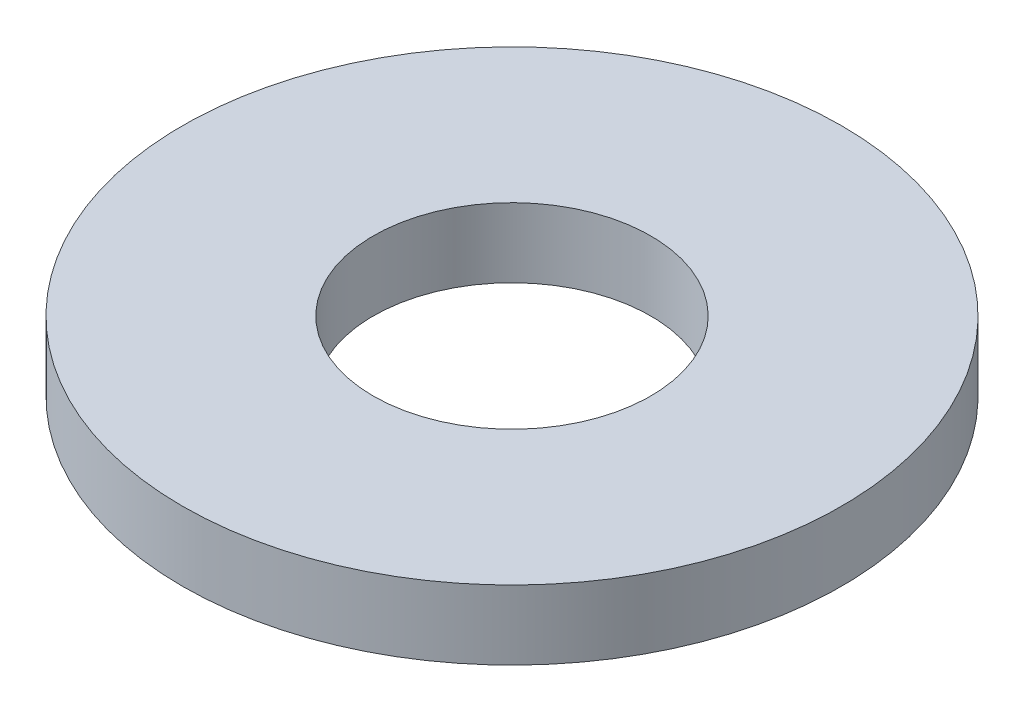
ISO-10303-21;
HEADER;
FILE_DESCRIPTION(('STEP AP214'),'2;1');
FILE_NAME('part.step','',(''),(''),'','','');
FILE_SCHEMA(('AUTOMOTIVE_DESIGN { 1 0 10303 214 1 1 1 1 }'));
ENDSEC;
DATA;
#1=APPLICATION_CONTEXT('core data for automotive mechanical design processes');
#2=APPLICATION_PROTOCOL_DEFINITION('international standard','automotive_design',2000,#1);
#3=PRODUCT_CONTEXT('',#1,'mechanical');
#4=PRODUCT('Part','Part','',(#3));
#5=PRODUCT_RELATED_PRODUCT_CATEGORY('part','',(#4));
#6=PRODUCT_DEFINITION_FORMATION('','',#4);
#7=PRODUCT_DEFINITION_CONTEXT('part definition',#1,'design');
#8=PRODUCT_DEFINITION('design','',#6,#7);
#9=PRODUCT_DEFINITION_SHAPE('','',#8);
#10=(LENGTH_UNIT() NAMED_UNIT(*) SI_UNIT(.MILLI.,.METRE.));
#11=(NAMED_UNIT(*) PLANE_ANGLE_UNIT() SI_UNIT($,.RADIAN.));
#12=(NAMED_UNIT(*) SI_UNIT($,.STERADIAN.) SOLID_ANGLE_UNIT());
#13=UNCERTAINTY_MEASURE_WITH_UNIT(LENGTH_MEASURE(1.E-05),#10,'distance_accuracy_value','');
#14=(GEOMETRIC_REPRESENTATION_CONTEXT(3) GLOBAL_UNCERTAINTY_ASSIGNED_CONTEXT((#13)) GLOBAL_UNIT_ASSIGNED_CONTEXT((#10,
#11,#12)) REPRESENTATION_CONTEXT('',''));
#15=CARTESIAN_POINT('',(0.,0.,0.));
#16=DIRECTION('',(0.,0.,1.));
#17=DIRECTION('',(1.,0.,0.));
#18=AXIS2_PLACEMENT_3D('',#15,#16,#17);
#19=CARTESIAN_POINT('',(0.,2.,0.));
#20=DIRECTION('',(0.,1.,0.));
#21=DIRECTION('',(0.,0.,1.));
#22=AXIS2_PLACEMENT_3D('',#19,#20,#21);
#23=PLANE('',#22);
#24=CARTESIAN_POINT('',(0.,2.,0.));
#25=DIRECTION('',(0.,1.,0.));
#26=DIRECTION('',(0.,0.,1.));
#27=AXIS2_PLACEMENT_3D('',#24,#25,#26);
#28=CIRCLE('',#27,9.50000000000001);
#29=CARTESIAN_POINT('',(0.,2.,9.50000000000001));
#30=VERTEX_POINT('',#29);
#31=EDGE_CURVE('E10',#30,#30,#28,.T.);
#32=ORIENTED_EDGE('',*,*,#31,.T.);
#33=EDGE_LOOP('',(#32));
#34=FACE_BOUND('',#33,.T.);
#35=CARTESIAN_POINT('',(0.,2.,0.));
#36=DIRECTION('',(0.,1.,0.));
#37=DIRECTION('',(0.,0.,1.));
#38=AXIS2_PLACEMENT_3D('',#35,#36,#37);
#39=CIRCLE('',#38,4.);
#40=CARTESIAN_POINT('',(0.,2.,4.));
#41=VERTEX_POINT('',#40);
#42=EDGE_CURVE('E50',#41,#41,#39,.T.);
#43=ORIENTED_EDGE('',*,*,#42,.F.);
#44=EDGE_LOOP('',(#43));
#45=FACE_BOUND('',#44,.T.);
#46=ADVANCED_FACE('F37',(#34,#45),#23,.T.);
#47=CARTESIAN_POINT('',(0.,0.,0.));
#48=DIRECTION('',(0.,1.,0.));
#49=DIRECTION('',(0.,0.,1.));
#50=AXIS2_PLACEMENT_3D('',#47,#48,#49);
#51=PLANE('',#50);
#52=CARTESIAN_POINT('',(0.,0.,0.));
#53=DIRECTION('',(0.,1.,0.));
#54=DIRECTION('',(0.,0.,1.));
#55=AXIS2_PLACEMENT_3D('',#52,#53,#54);
#56=CIRCLE('',#55,9.50000000000001);
#57=CARTESIAN_POINT('',(0.,0.,9.50000000000001));
#58=VERTEX_POINT('',#57);
#59=EDGE_CURVE('E41',#58,#58,#56,.T.);
#60=ORIENTED_EDGE('',*,*,#59,.F.);
#61=EDGE_LOOP('',(#60));
#62=FACE_BOUND('',#61,.T.);
#63=CARTESIAN_POINT('',(0.,0.,0.));
#64=DIRECTION('',(0.,1.,0.));
#65=DIRECTION('',(0.,0.,1.));
#66=AXIS2_PLACEMENT_3D('',#63,#64,#65);
#67=CIRCLE('',#66,4.);
#68=CARTESIAN_POINT('',(0.,0.,4.));
#69=VERTEX_POINT('',#68);
#70=EDGE_CURVE('E52',#69,#69,#67,.T.);
#71=ORIENTED_EDGE('',*,*,#70,.T.);
#72=EDGE_LOOP('',(#71));
#73=FACE_BOUND('',#72,.T.);
#74=ADVANCED_FACE('F64',(#62,#73),#51,.F.);
#75=CARTESIAN_POINT('',(0.,2.,0.));
#76=DIRECTION('',(0.,-1.,0.));
#77=DIRECTION('',(0.,0.,-1.));
#78=AXIS2_PLACEMENT_3D('',#75,#76,#77);
#79=CYLINDRICAL_SURFACE('',#78,9.50000000000001);
#80=ORIENTED_EDGE('',*,*,#31,.F.);
#81=EDGE_LOOP('',(#80));
#82=FACE_BOUND('',#81,.T.);
#83=ORIENTED_EDGE('',*,*,#59,.T.);
#84=EDGE_LOOP('',(#83));
#85=FACE_BOUND('',#84,.T.);
#86=ADVANCED_FACE('F39',(#82,#85),#79,.T.);
#87=CARTESIAN_POINT('',(0.,2.,0.));
#88=DIRECTION('',(0.,-1.,0.));
#89=DIRECTION('',(0.,0.,-1.));
#90=AXIS2_PLACEMENT_3D('',#87,#88,#89);
#91=CYLINDRICAL_SURFACE('',#90,4.);
#92=ORIENTED_EDGE('',*,*,#42,.T.);
#93=EDGE_LOOP('',(#92));
#94=FACE_BOUND('',#93,.T.);
#95=ORIENTED_EDGE('',*,*,#70,.F.);
#96=EDGE_LOOP('',(#95));
#97=FACE_BOUND('',#96,.T.);
#98=ADVANCED_FACE('F60',(#94,#97),#91,.F.);
#99=CLOSED_SHELL('',(#46,#74,#86,#98));
#100=MANIFOLD_SOLID_BREP('B2',#99);
#101=ADVANCED_BREP_SHAPE_REPRESENTATION('',(#18,#100),#14);
#102=SHAPE_DEFINITION_REPRESENTATION(#9,#101);
ENDSEC;
END-ISO-10303-21;
